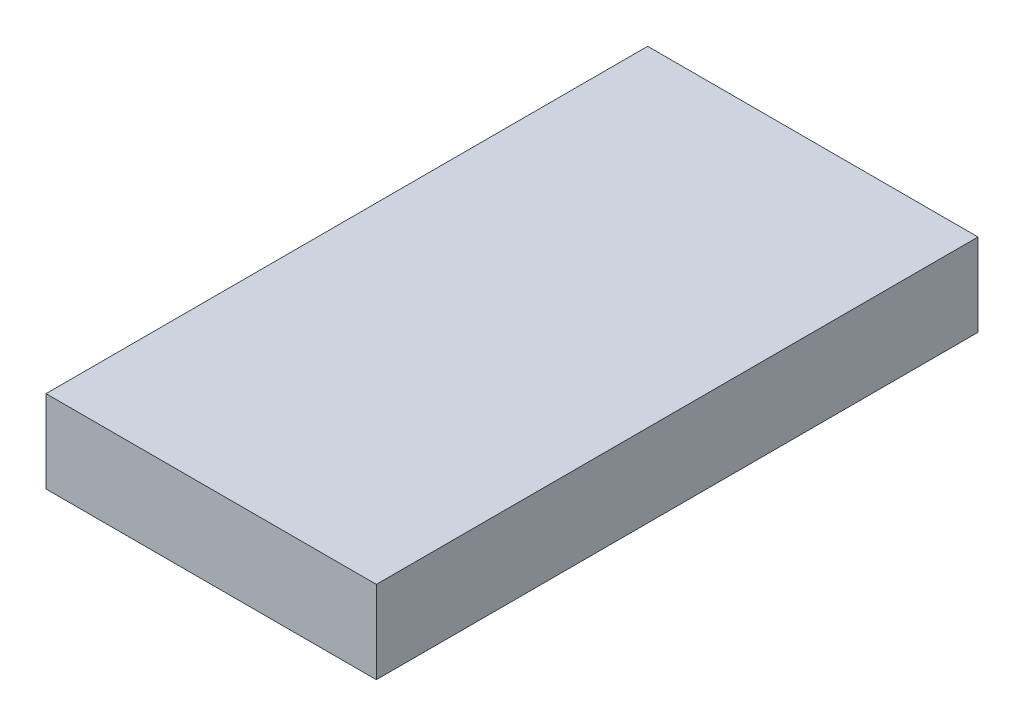
ISO-10303-21;
HEADER;
FILE_DESCRIPTION(('STEP AP214'),'2;1');
FILE_NAME('part.step','',(''),(''),'','','');
FILE_SCHEMA(('AUTOMOTIVE_DESIGN { 1 0 10303 214 1 1 1 1 }'));
ENDSEC;
DATA;
#1=APPLICATION_CONTEXT('core data for automotive mechanical design processes');
#2=APPLICATION_PROTOCOL_DEFINITION('international standard','automotive_design',2000,#1);
#3=PRODUCT_CONTEXT('',#1,'mechanical');
#4=PRODUCT('Part','Part','',(#3));
#5=PRODUCT_RELATED_PRODUCT_CATEGORY('part','',(#4));
#6=PRODUCT_DEFINITION_FORMATION('','',#4);
#7=PRODUCT_DEFINITION_CONTEXT('part definition',#1,'design');
#8=PRODUCT_DEFINITION('design','',#6,#7);
#9=PRODUCT_DEFINITION_SHAPE('','',#8);
#10=(LENGTH_UNIT() NAMED_UNIT(*) SI_UNIT(.MILLI.,.METRE.));
#11=(NAMED_UNIT(*) PLANE_ANGLE_UNIT() SI_UNIT($,.RADIAN.));
#12=(NAMED_UNIT(*) SI_UNIT($,.STERADIAN.) SOLID_ANGLE_UNIT());
#13=UNCERTAINTY_MEASURE_WITH_UNIT(LENGTH_MEASURE(1.E-05),#10,'distance_accuracy_value','');
#14=(GEOMETRIC_REPRESENTATION_CONTEXT(3) GLOBAL_UNCERTAINTY_ASSIGNED_CONTEXT((#13)) GLOBAL_UNIT_ASSIGNED_CONTEXT((#10,
#11,#12)) REPRESENTATION_CONTEXT('',''));
#15=CARTESIAN_POINT('',(0.,0.,0.));
#16=DIRECTION('',(0.,0.,1.));
#17=DIRECTION('',(1.,0.,0.));
#18=AXIS2_PLACEMENT_3D('',#15,#16,#17);
#19=CARTESIAN_POINT('',(-56.,14.,-204.));
#20=DIRECTION('',(-1.,0.,0.));
#21=DIRECTION('',(0.,0.,1.));
#22=AXIS2_PLACEMENT_3D('',#19,#20,#21);
#23=PLANE('',#22);
#24=DIRECTION('',(0.,-1.,0.));
#25=VECTOR('',#24,1.);
#26=CARTESIAN_POINT('',(-56.,14.,0.));
#27=LINE('',#26,#25);
#28=CARTESIAN_POINT('',(-56.,14.,0.));
#29=VERTEX_POINT('',#28);
#30=CARTESIAN_POINT('',(-56.,-14.,0.));
#31=VERTEX_POINT('',#30);
#32=EDGE_CURVE('E98',#29,#31,#27,.T.);
#33=ORIENTED_EDGE('',*,*,#32,.F.);
#34=DIRECTION('',(0.,0.,1.));
#35=VECTOR('',#34,1.);
#36=CARTESIAN_POINT('',(-56.,14.,-204.));
#37=LINE('',#36,#35);
#38=CARTESIAN_POINT('',(-56.,14.,-204.));
#39=VERTEX_POINT('',#38);
#40=EDGE_CURVE('E11',#39,#29,#37,.T.);
#41=ORIENTED_EDGE('',*,*,#40,.F.);
#42=DIRECTION('',(0.,-1.,0.));
#43=VECTOR('',#42,1.);
#44=CARTESIAN_POINT('',(-56.,14.,-204.));
#45=LINE('',#44,#43);
#46=CARTESIAN_POINT('',(-56.,-14.,-204.));
#47=VERTEX_POINT('',#46);
#48=EDGE_CURVE('E93',#39,#47,#45,.T.);
#49=ORIENTED_EDGE('',*,*,#48,.T.);
#50=DIRECTION('',(0.,0.,1.));
#51=VECTOR('',#50,1.);
#52=CARTESIAN_POINT('',(-56.,-14.,-204.));
#53=LINE('',#52,#51);
#54=EDGE_CURVE('E36',#47,#31,#53,.T.);
#55=ORIENTED_EDGE('',*,*,#54,.T.);
#56=EDGE_LOOP('',(#33,#41,#49,#55));
#57=FACE_BOUND('',#56,.T.);
#58=ADVANCED_FACE('F33',(#57),#23,.T.);
#59=CARTESIAN_POINT('',(-56.,14.,-204.));
#60=DIRECTION('',(0.,-1.,0.));
#61=DIRECTION('',(0.,0.,-1.));
#62=AXIS2_PLACEMENT_3D('',#59,#60,#61);
#63=PLANE('',#62);
#64=DIRECTION('',(1.,0.,0.));
#65=VECTOR('',#64,1.);
#66=CARTESIAN_POINT('',(-56.,14.,0.));
#67=LINE('',#66,#65);
#68=CARTESIAN_POINT('',(56.,14.,0.));
#69=VERTEX_POINT('',#68);
#70=EDGE_CURVE('E66',#29,#69,#67,.T.);
#71=ORIENTED_EDGE('',*,*,#70,.T.);
#72=DIRECTION('',(0.,0.,1.));
#73=VECTOR('',#72,1.);
#74=CARTESIAN_POINT('',(56.,14.,-204.));
#75=LINE('',#74,#73);
#76=CARTESIAN_POINT('',(56.,14.,-204.));
#77=VERTEX_POINT('',#76);
#78=EDGE_CURVE('E42',#77,#69,#75,.T.);
#79=ORIENTED_EDGE('',*,*,#78,.F.);
#80=DIRECTION('',(1.,0.,0.));
#81=VECTOR('',#80,1.);
#82=CARTESIAN_POINT('',(-56.,14.,-204.));
#83=LINE('',#82,#81);
#84=EDGE_CURVE('E83',#39,#77,#83,.T.);
#85=ORIENTED_EDGE('',*,*,#84,.F.);
#86=ORIENTED_EDGE('',*,*,#40,.T.);
#87=EDGE_LOOP('',(#71,#79,#85,#86));
#88=FACE_BOUND('',#87,.T.);
#89=ADVANCED_FACE('F108',(#88),#63,.F.);
#90=CARTESIAN_POINT('',(56.,14.,-204.));
#91=DIRECTION('',(-1.,0.,0.));
#92=DIRECTION('',(0.,0.,1.));
#93=AXIS2_PLACEMENT_3D('',#90,#91,#92);
#94=PLANE('',#93);
#95=DIRECTION('',(0.,-1.,0.));
#96=VECTOR('',#95,1.);
#97=CARTESIAN_POINT('',(56.,14.,0.));
#98=LINE('',#97,#96);
#99=CARTESIAN_POINT('',(56.,-14.,0.));
#100=VERTEX_POINT('',#99);
#101=EDGE_CURVE('E90',#69,#100,#98,.T.);
#102=ORIENTED_EDGE('',*,*,#101,.T.);
#103=DIRECTION('',(0.,0.,1.));
#104=VECTOR('',#103,1.);
#105=CARTESIAN_POINT('',(56.,-14.,-204.));
#106=LINE('',#105,#104);
#107=CARTESIAN_POINT('',(56.,-14.,-204.));
#108=VERTEX_POINT('',#107);
#109=EDGE_CURVE('E87',#108,#100,#106,.T.);
#110=ORIENTED_EDGE('',*,*,#109,.F.);
#111=DIRECTION('',(0.,-1.,0.));
#112=VECTOR('',#111,1.);
#113=CARTESIAN_POINT('',(56.,14.,-204.));
#114=LINE('',#113,#112);
#115=EDGE_CURVE('E78',#77,#108,#114,.T.);
#116=ORIENTED_EDGE('',*,*,#115,.F.);
#117=ORIENTED_EDGE('',*,*,#78,.T.);
#118=EDGE_LOOP('',(#102,#110,#116,#117));
#119=FACE_BOUND('',#118,.T.);
#120=ADVANCED_FACE('F88',(#119),#94,.F.);
#121=CARTESIAN_POINT('',(-56.,-14.,-204.));
#122=DIRECTION('',(0.,-1.,0.));
#123=DIRECTION('',(1.,0.,0.));
#124=AXIS2_PLACEMENT_3D('',#121,#122,#123);
#125=PLANE('',#124);
#126=DIRECTION('',(1.,0.,0.));
#127=VECTOR('',#126,1.);
#128=CARTESIAN_POINT('',(-56.,-14.,0.));
#129=LINE('',#128,#127);
#130=EDGE_CURVE('E101',#31,#100,#129,.T.);
#131=ORIENTED_EDGE('',*,*,#130,.F.);
#132=ORIENTED_EDGE('',*,*,#54,.F.);
#133=DIRECTION('',(1.,0.,0.));
#134=VECTOR('',#133,1.);
#135=CARTESIAN_POINT('',(-56.,-14.,-204.));
#136=LINE('',#135,#134);
#137=EDGE_CURVE('E82',#47,#108,#136,.T.);
#138=ORIENTED_EDGE('',*,*,#137,.T.);
#139=ORIENTED_EDGE('',*,*,#109,.T.);
#140=EDGE_LOOP('',(#131,#132,#138,#139));
#141=FACE_BOUND('',#140,.T.);
#142=ADVANCED_FACE('F92',(#141),#125,.T.);
#143=CARTESIAN_POINT('',(0.,0.,-204.));
#144=DIRECTION('',(0.,0.,1.));
#145=DIRECTION('',(1.,0.,0.));
#146=AXIS2_PLACEMENT_3D('',#143,#144,#145);
#147=PLANE('',#146);
#148=ORIENTED_EDGE('',*,*,#48,.F.);
#149=ORIENTED_EDGE('',*,*,#84,.T.);
#150=ORIENTED_EDGE('',*,*,#115,.T.);
#151=ORIENTED_EDGE('',*,*,#137,.F.);
#152=EDGE_LOOP('',(#148,#149,#150,#151));
#153=FACE_BOUND('',#152,.T.);
#154=ADVANCED_FACE('F81',(#153),#147,.F.);
#155=CARTESIAN_POINT('',(0.,0.,0.));
#156=DIRECTION('',(0.,0.,1.));
#157=DIRECTION('',(1.,0.,0.));
#158=AXIS2_PLACEMENT_3D('',#155,#156,#157);
#159=PLANE('',#158);
#160=ORIENTED_EDGE('',*,*,#32,.T.);
#161=ORIENTED_EDGE('',*,*,#130,.T.);
#162=ORIENTED_EDGE('',*,*,#101,.F.);
#163=ORIENTED_EDGE('',*,*,#70,.F.);
#164=EDGE_LOOP('',(#160,#161,#162,#163));
#165=FACE_BOUND('',#164,.T.);
#166=ADVANCED_FACE('F106',(#165),#159,.T.);
#167=CLOSED_SHELL('',(#58,#89,#120,#142,#154,#166));
#168=MANIFOLD_SOLID_BREP('B2',#167);
#169=ADVANCED_BREP_SHAPE_REPRESENTATION('',(#18,#168),#14);
#170=SHAPE_DEFINITION_REPRESENTATION(#9,#169);
ENDSEC;
END-ISO-10303-21;
